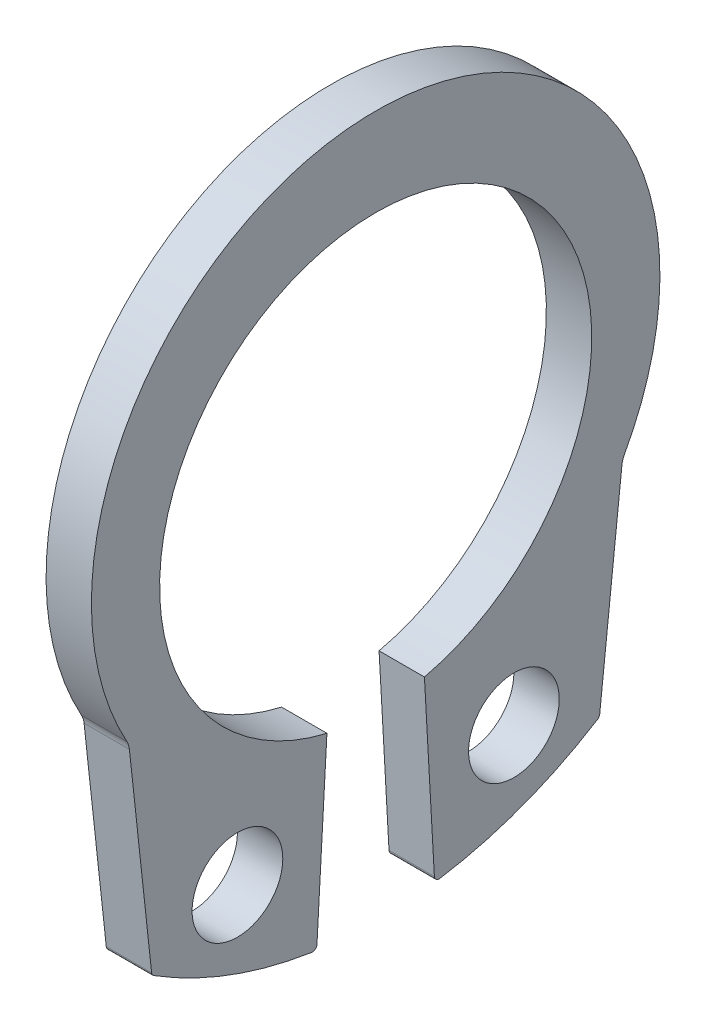
ISO-10303-21;
HEADER;
FILE_DESCRIPTION(('STEP AP214'),'2;1');
FILE_NAME('part.step','',(''),(''),'','','');
FILE_SCHEMA(('AUTOMOTIVE_DESIGN { 1 0 10303 214 1 1 1 1 }'));
ENDSEC;
DATA;
#1=APPLICATION_CONTEXT('core data for automotive mechanical design processes');
#2=APPLICATION_PROTOCOL_DEFINITION('international standard','automotive_design',2000,#1);
#3=PRODUCT_CONTEXT('',#1,'mechanical');
#4=PRODUCT('Part','Part','',(#3));
#5=PRODUCT_RELATED_PRODUCT_CATEGORY('part','',(#4));
#6=PRODUCT_DEFINITION_FORMATION('','',#4);
#7=PRODUCT_DEFINITION_CONTEXT('part definition',#1,'design');
#8=PRODUCT_DEFINITION('design','',#6,#7);
#9=PRODUCT_DEFINITION_SHAPE('','',#8);
#10=(LENGTH_UNIT() NAMED_UNIT(*) SI_UNIT(.MILLI.,.METRE.));
#11=(NAMED_UNIT(*) PLANE_ANGLE_UNIT() SI_UNIT($,.RADIAN.));
#12=(NAMED_UNIT(*) SI_UNIT($,.STERADIAN.) SOLID_ANGLE_UNIT());
#13=UNCERTAINTY_MEASURE_WITH_UNIT(LENGTH_MEASURE(1.E-05),#10,'distance_accuracy_value','');
#14=(GEOMETRIC_REPRESENTATION_CONTEXT(3) GLOBAL_UNCERTAINTY_ASSIGNED_CONTEXT((#13)) GLOBAL_UNIT_ASSIGNED_CONTEXT((#10,
#11,#12)) REPRESENTATION_CONTEXT('',''));
#15=CARTESIAN_POINT('',(0.,0.,0.));
#16=DIRECTION('',(0.,0.,1.));
#17=DIRECTION('',(1.,0.,0.));
#18=AXIS2_PLACEMENT_3D('',#15,#16,#17);
#19=CARTESIAN_POINT('',(0.85,-2.39792397685185,-5.01373537734668));
#20=DIRECTION('',(-1.,0.,0.));
#21=DIRECTION('',(0.,0.,1.));
#22=AXIS2_PLACEMENT_3D('',#19,#20,#21);
#23=CYLINDRICAL_SURFACE('',#22,0.4);
#24=CARTESIAN_POINT('',(0.85,-2.39792397685185,-5.01373537734668));
#25=DIRECTION('',(-1.,0.,0.));
#26=DIRECTION('',(0.,0.,-1.));
#27=AXIS2_PLACEMENT_3D('',#24,#25,#26);
#28=CIRCLE('',#27,0.4);
#29=CARTESIAN_POINT('',(0.85,-2.3547374993622,-4.61607355096397));
#30=VERTEX_POINT('',#29);
#31=CARTESIAN_POINT('',(0.85,-2.20449375873755,-4.6636143258227));
#32=VERTEX_POINT('',#31);
#33=EDGE_CURVE('E37',#30,#32,#28,.T.);
#34=ORIENTED_EDGE('',*,*,#33,.F.);
#35=DIRECTION('',(1.,0.,0.));
#36=VECTOR('',#35,1.);
#37=CARTESIAN_POINT('',(0.85,-2.3547374993622,-4.61607355096397));
#38=LINE('',#37,#36);
#39=CARTESIAN_POINT('',(0.,-2.3547374993622,-4.61607355096397));
#40=VERTEX_POINT('',#39);
#41=EDGE_CURVE('E211',#40,#30,#38,.T.);
#42=ORIENTED_EDGE('',*,*,#41,.F.);
#43=CARTESIAN_POINT('',(0.,-2.39792397685185,-5.01373537734668));
#44=DIRECTION('',(1.,0.,0.));
#45=DIRECTION('',(0.,0.,-1.));
#46=AXIS2_PLACEMENT_3D('',#43,#44,#45);
#47=CIRCLE('',#46,0.4);
#48=CARTESIAN_POINT('',(0.,-2.20449375873755,-4.6636143258227));
#49=VERTEX_POINT('',#48);
#50=EDGE_CURVE('E11',#49,#40,#47,.T.);
#51=ORIENTED_EDGE('',*,*,#50,.F.);
#52=DIRECTION('',(-1.,0.,0.));
#53=VECTOR('',#52,1.);
#54=CARTESIAN_POINT('',(0.85,-2.20449375873755,-4.6636143258227));
#55=LINE('',#54,#53);
#56=EDGE_CURVE('E187',#32,#49,#55,.T.);
#57=ORIENTED_EDGE('',*,*,#56,.F.);
#58=EDGE_LOOP('',(#34,#42,#51,#57));
#59=FACE_BOUND('',#58,.T.);
#60=ADVANCED_FACE('F17',(#59),#23,.F.);
#61=CARTESIAN_POINT('',(0.85,-2.39792397685184,5.01373537734669));
#62=DIRECTION('',(-1.,0.,0.));
#63=DIRECTION('',(0.,0.,1.));
#64=AXIS2_PLACEMENT_3D('',#61,#62,#63);
#65=CYLINDRICAL_SURFACE('',#64,0.4);
#66=CARTESIAN_POINT('',(0.85,-2.39792397685184,5.01373537734669));
#67=DIRECTION('',(-1.,0.,0.));
#68=DIRECTION('',(0.,0.,-1.));
#69=AXIS2_PLACEMENT_3D('',#66,#67,#68);
#70=CIRCLE('',#69,0.4);
#71=CARTESIAN_POINT('',(0.85,-2.20449375873754,4.66361432582271));
#72=VERTEX_POINT('',#71);
#73=CARTESIAN_POINT('',(0.85,-2.35473749936219,4.61607355096397));
#74=VERTEX_POINT('',#73);
#75=EDGE_CURVE('E175',#72,#74,#70,.T.);
#76=ORIENTED_EDGE('',*,*,#75,.F.);
#77=DIRECTION('',(1.,0.,0.));
#78=VECTOR('',#77,1.);
#79=CARTESIAN_POINT('',(0.85,-2.20449375873754,4.66361432582271));
#80=LINE('',#79,#78);
#81=CARTESIAN_POINT('',(0.,-2.20449375873754,4.66361432582271));
#82=VERTEX_POINT('',#81);
#83=EDGE_CURVE('E178',#82,#72,#80,.T.);
#84=ORIENTED_EDGE('',*,*,#83,.F.);
#85=CARTESIAN_POINT('',(0.,-2.39792397685184,5.01373537734669));
#86=DIRECTION('',(1.,0.,0.));
#87=DIRECTION('',(0.,0.,-1.));
#88=AXIS2_PLACEMENT_3D('',#85,#86,#87);
#89=CIRCLE('',#88,0.4);
#90=CARTESIAN_POINT('',(0.,-2.35473749936219,4.61607355096397));
#91=VERTEX_POINT('',#90);
#92=EDGE_CURVE('E25',#91,#82,#89,.T.);
#93=ORIENTED_EDGE('',*,*,#92,.F.);
#94=DIRECTION('',(-1.,0.,0.));
#95=VECTOR('',#94,1.);
#96=CARTESIAN_POINT('',(0.85,-2.35473749936219,4.61607355096397));
#97=LINE('',#96,#95);
#98=EDGE_CURVE('E223',#74,#91,#97,.T.);
#99=ORIENTED_EDGE('',*,*,#98,.F.);
#100=EDGE_LOOP('',(#76,#84,#93,#99));
#101=FACE_BOUND('',#100,.T.);
#102=ADVANCED_FACE('F179',(#101),#65,.F.);
#103=CARTESIAN_POINT('',(0.,0.,0.));
#104=DIRECTION('',(1.,0.,0.));
#105=DIRECTION('',(0.,1.,0.));
#106=AXIS2_PLACEMENT_3D('',#103,#104,#105);
#107=PLANE('',#106);
#108=CARTESIAN_POINT('',(0.,-5.56782224250959,2.59106511830008));
#109=DIRECTION('',(1.,0.,0.));
#110=DIRECTION('',(0.,0.,-1.));
#111=AXIS2_PLACEMENT_3D('',#108,#109,#110);
#112=CIRCLE('',#111,0.85);
#113=CARTESIAN_POINT('',(0.,-5.56782224250959,1.74106511830008));
#114=VERTEX_POINT('',#113);
#115=EDGE_CURVE('E337',#114,#114,#112,.T.);
#116=ORIENTED_EDGE('',*,*,#115,.T.);
#117=EDGE_LOOP('',(#116));
#118=FACE_BOUND('',#117,.T.);
#119=CARTESIAN_POINT('',(0.,-5.56782224250959,-2.59106511830008));
#120=DIRECTION('',(-1.,0.,0.));
#121=DIRECTION('',(0.,0.,-1.));
#122=AXIS2_PLACEMENT_3D('',#119,#120,#121);
#123=CIRCLE('',#122,0.85);
#124=CARTESIAN_POINT('',(0.,-5.56782224250959,-3.44106511830008));
#125=VERTEX_POINT('',#124);
#126=EDGE_CURVE('E332',#125,#125,#123,.T.);
#127=ORIENTED_EDGE('',*,*,#126,.F.);
#128=EDGE_LOOP('',(#127));
#129=FACE_BOUND('',#128,.T.);
#130=DIRECTION('',(0.,0.994154565956785,0.107966193724127));
#131=VECTOR('',#130,1.);
#132=CARTESIAN_POINT('',(0.,-0.522915110689556,4.81501131945199));
#133=LINE('',#132,#131);
#134=CARTESIAN_POINT('',(0.,-6.19075573329271,4.19947808185275));
#135=VERTEX_POINT('',#134);
#136=EDGE_CURVE('E170',#135,#91,#133,.T.);
#137=ORIENTED_EDGE('',*,*,#136,.T.);
#138=ORIENTED_EDGE('',*,*,#92,.T.);
#139=CARTESIAN_POINT('',(0.,0.371997807017542,0.));
#140=DIRECTION('',(1.,0.,0.));
#141=DIRECTION('',(0.,0.,-1.));
#142=AXIS2_PLACEMENT_3D('',#139,#140,#141);
#143=CIRCLE('',#142,5.32800219298246);
#144=EDGE_CURVE('E167',#49,#82,#143,.T.);
#145=ORIENTED_EDGE('',*,*,#144,.F.);
#146=ORIENTED_EDGE('',*,*,#50,.T.);
#147=DIRECTION('',(0.,0.994154565956785,-0.107966193724126));
#148=VECTOR('',#147,1.);
#149=CARTESIAN_POINT('',(0.,-0.522915110689551,-4.81501131945199));
#150=LINE('',#149,#148);
#151=CARTESIAN_POINT('',(0.,-6.19075573329271,-4.19947808185275));
#152=VERTEX_POINT('',#151);
#153=EDGE_CURVE('E231',#152,#40,#150,.T.);
#154=ORIENTED_EDGE('',*,*,#153,.F.);
#155=CARTESIAN_POINT('',(0.,-6.1811158134206,-4.11071353412026));
#156=DIRECTION('',(-1.,0.,0.));
#157=DIRECTION('',(0.,0.,-1.));
#158=AXIS2_PLACEMENT_3D('',#155,#156,#157);
#159=CIRCLE('',#158,0.0892864658797376);
#160=CARTESIAN_POINT('',(0.,-6.25675257958271,-4.15815984687302));
#161=VERTEX_POINT('',#160);
#162=EDGE_CURVE('E272',#152,#161,#159,.T.);
#163=ORIENTED_EDGE('',*,*,#162,.T.);
#164=CARTESIAN_POINT('',(0.,0.371997807017542,0.));
#165=DIRECTION('',(1.,0.,0.));
#166=DIRECTION('',(0.,0.,-1.));
#167=AXIS2_PLACEMENT_3D('',#164,#165,#166);
#168=CIRCLE('',#167,7.825);
#169=CARTESIAN_POINT('',(0.,-7.35997373313335,-1.20301334252644));
#170=VERTEX_POINT('',#169);
#171=EDGE_CURVE('E262',#170,#161,#168,.T.);
#172=ORIENTED_EDGE('',*,*,#171,.F.);
#173=CARTESIAN_POINT('',(0.,-7.27174876021286,-1.18928646587975));
#174=DIRECTION('',(-1.,0.,0.));
#175=DIRECTION('',(0.,0.,-1.));
#176=AXIS2_PLACEMENT_3D('',#173,#174,#175);
#177=CIRCLE('',#176,0.0892864658797398);
#178=CARTESIAN_POINT('',(0.,-7.27674135002132,-1.1001396934407));
#179=VERTEX_POINT('',#178);
#180=EDGE_CURVE('E287',#170,#179,#177,.T.);
#181=ORIENTED_EDGE('',*,*,#180,.T.);
#182=DIRECTION('',(0.,0.998435446634371,0.0559165351575345));
#183=VECTOR('',#182,1.);
#184=CARTESIAN_POINT('',(0.,0.0386678666475541,-0.690446369716576));
#185=LINE('',#184,#183);
#186=CARTESIAN_POINT('',(0.,-3.94561359779142,-0.913582692985955));
#187=VERTEX_POINT('',#186);
#188=EDGE_CURVE('E212',#179,#187,#185,.T.);
#189=ORIENTED_EDGE('',*,*,#188,.T.);
#190=CARTESIAN_POINT('',(0.,0.,0.));
#191=DIRECTION('',(1.,0.,0.));
#192=DIRECTION('',(0.,0.,-1.));
#193=AXIS2_PLACEMENT_3D('',#190,#191,#192);
#194=CIRCLE('',#193,4.05);
#195=CARTESIAN_POINT('',(0.,-3.94561359779142,0.913582692985955));
#196=VERTEX_POINT('',#195);
#197=EDGE_CURVE('E202',#187,#196,#194,.T.);
#198=ORIENTED_EDGE('',*,*,#197,.T.);
#199=DIRECTION('',(0.,0.998435446634371,-0.0559165351575343));
#200=VECTOR('',#199,1.);
#201=CARTESIAN_POINT('',(0.,0.0386678666475539,0.690446369716574));
#202=LINE('',#201,#200);
#203=CARTESIAN_POINT('',(0.,-7.27674135002132,1.1001396934407));
#204=VERTEX_POINT('',#203);
#205=EDGE_CURVE('E276',#204,#196,#202,.T.);
#206=ORIENTED_EDGE('',*,*,#205,.F.);
#207=CARTESIAN_POINT('',(0.,-7.27174876021286,1.18928646587974));
#208=DIRECTION('',(1.,0.,0.));
#209=DIRECTION('',(0.,0.,-1.));
#210=AXIS2_PLACEMENT_3D('',#207,#208,#209);
#211=CIRCLE('',#210,0.0892864658797448);
#212=CARTESIAN_POINT('',(0.,-7.35997373313335,1.20301334252644));
#213=VERTEX_POINT('',#212);
#214=EDGE_CURVE('E252',#213,#204,#211,.T.);
#215=ORIENTED_EDGE('',*,*,#214,.F.);
#216=CARTESIAN_POINT('',(0.,0.371997807017542,0.));
#217=DIRECTION('',(1.,0.,0.));
#218=DIRECTION('',(0.,0.,-1.));
#219=AXIS2_PLACEMENT_3D('',#216,#217,#218);
#220=CIRCLE('',#219,7.825);
#221=CARTESIAN_POINT('',(0.,-6.25675257958271,4.15815984687302));
#222=VERTEX_POINT('',#221);
#223=EDGE_CURVE('E243',#222,#213,#220,.T.);
#224=ORIENTED_EDGE('',*,*,#223,.F.);
#225=CARTESIAN_POINT('',(0.,-6.1811158134206,4.11071353412026));
#226=DIRECTION('',(1.,0.,0.));
#227=DIRECTION('',(0.,0.,-1.));
#228=AXIS2_PLACEMENT_3D('',#225,#226,#227);
#229=CIRCLE('',#228,0.0892864658797463);
#230=EDGE_CURVE('E227',#135,#222,#229,.T.);
#231=ORIENTED_EDGE('',*,*,#230,.F.);
#232=EDGE_LOOP('',(#137,#138,#145,#146,#154,#163,#172,#181,#189,#198,#206,#215,#224,#231));
#233=FACE_BOUND('',#232,.T.);
#234=ADVANCED_FACE('F165',(#118,#129,#233),#107,.F.);
#235=CARTESIAN_POINT('',(0.85,0.,0.));
#236=DIRECTION('',(1.,0.,0.));
#237=DIRECTION('',(0.,1.,0.));
#238=AXIS2_PLACEMENT_3D('',#235,#236,#237);
#239=PLANE('',#238);
#240=CARTESIAN_POINT('',(0.85,-5.56782224250959,2.59106511830008));
#241=DIRECTION('',(1.,0.,0.));
#242=DIRECTION('',(0.,0.,-1.));
#243=AXIS2_PLACEMENT_3D('',#240,#241,#242);
#244=CIRCLE('',#243,0.85);
#245=CARTESIAN_POINT('',(0.85,-5.56782224250959,1.74106511830008));
#246=VERTEX_POINT('',#245);
#247=EDGE_CURVE('E328',#246,#246,#244,.T.);
#248=ORIENTED_EDGE('',*,*,#247,.F.);
#249=EDGE_LOOP('',(#248));
#250=FACE_BOUND('',#249,.T.);
#251=CARTESIAN_POINT('',(0.85,-5.56782224250959,-2.59106511830008));
#252=DIRECTION('',(-1.,0.,0.));
#253=DIRECTION('',(0.,0.,-1.));
#254=AXIS2_PLACEMENT_3D('',#251,#252,#253);
#255=CIRCLE('',#254,0.85);
#256=CARTESIAN_POINT('',(0.85,-5.56782224250959,-3.44106511830008));
#257=VERTEX_POINT('',#256);
#258=EDGE_CURVE('E386',#257,#257,#255,.T.);
#259=ORIENTED_EDGE('',*,*,#258,.T.);
#260=EDGE_LOOP('',(#259));
#261=FACE_BOUND('',#260,.T.);
#262=DIRECTION('',(0.,0.994154565956785,0.107966193724127));
#263=VECTOR('',#262,1.);
#264=CARTESIAN_POINT('',(0.85,-0.522915110689556,4.81501131945199));
#265=LINE('',#264,#263);
#266=CARTESIAN_POINT('',(0.85,-6.19075573329271,4.19947808185275));
#267=VERTEX_POINT('',#266);
#268=EDGE_CURVE('E201',#267,#74,#265,.T.);
#269=ORIENTED_EDGE('',*,*,#268,.F.);
#270=CARTESIAN_POINT('',(0.85,-6.1811158134206,4.11071353412026));
#271=DIRECTION('',(1.,0.,0.));
#272=DIRECTION('',(0.,0.,-1.));
#273=AXIS2_PLACEMENT_3D('',#270,#271,#272);
#274=CIRCLE('',#273,0.0892864658797463);
#275=CARTESIAN_POINT('',(0.85,-6.25675257958271,4.15815984687302));
#276=VERTEX_POINT('',#275);
#277=EDGE_CURVE('E239',#267,#276,#274,.T.);
#278=ORIENTED_EDGE('',*,*,#277,.T.);
#279=CARTESIAN_POINT('',(0.85,0.371997807017542,0.));
#280=DIRECTION('',(1.,0.,0.));
#281=DIRECTION('',(0.,0.,-1.));
#282=AXIS2_PLACEMENT_3D('',#279,#280,#281);
#283=CIRCLE('',#282,7.825);
#284=CARTESIAN_POINT('',(0.85,-7.35997373313335,1.20301334252644));
#285=VERTEX_POINT('',#284);
#286=EDGE_CURVE('E248',#276,#285,#283,.T.);
#287=ORIENTED_EDGE('',*,*,#286,.T.);
#288=CARTESIAN_POINT('',(0.85,-7.27174876021286,1.18928646587974));
#289=DIRECTION('',(1.,0.,0.));
#290=DIRECTION('',(0.,0.,-1.));
#291=AXIS2_PLACEMENT_3D('',#288,#289,#290);
#292=CIRCLE('',#291,0.0892864658797448);
#293=CARTESIAN_POINT('',(0.85,-7.27674135002132,1.1001396934407));
#294=VERTEX_POINT('',#293);
#295=EDGE_CURVE('E266',#285,#294,#292,.T.);
#296=ORIENTED_EDGE('',*,*,#295,.T.);
#297=DIRECTION('',(0.,0.998435446634371,-0.0559165351575343));
#298=VECTOR('',#297,1.);
#299=CARTESIAN_POINT('',(0.85,0.0386678666475539,0.690446369716574));
#300=LINE('',#299,#298);
#301=CARTESIAN_POINT('',(0.85,-3.94561359779142,0.913582692985955));
#302=VERTEX_POINT('',#301);
#303=EDGE_CURVE('E216',#294,#302,#300,.T.);
#304=ORIENTED_EDGE('',*,*,#303,.T.);
#305=CARTESIAN_POINT('',(0.85,0.,0.));
#306=DIRECTION('',(1.,0.,0.));
#307=DIRECTION('',(0.,0.,-1.));
#308=AXIS2_PLACEMENT_3D('',#305,#306,#307);
#309=CIRCLE('',#308,4.05);
#310=CARTESIAN_POINT('',(0.85,-3.94561359779142,-0.913582692985955));
#311=VERTEX_POINT('',#310);
#312=EDGE_CURVE('E184',#311,#302,#309,.T.);
#313=ORIENTED_EDGE('',*,*,#312,.F.);
#314=DIRECTION('',(0.,0.998435446634371,0.0559165351575345));
#315=VECTOR('',#314,1.);
#316=CARTESIAN_POINT('',(0.85,0.0386678666475541,-0.690446369716576));
#317=LINE('',#316,#315);
#318=CARTESIAN_POINT('',(0.85,-7.27674135002132,-1.1001396934407));
#319=VERTEX_POINT('',#318);
#320=EDGE_CURVE('E284',#319,#311,#317,.T.);
#321=ORIENTED_EDGE('',*,*,#320,.F.);
#322=CARTESIAN_POINT('',(0.85,-7.27174876021286,-1.18928646587975));
#323=DIRECTION('',(-1.,0.,0.));
#324=DIRECTION('',(0.,0.,-1.));
#325=AXIS2_PLACEMENT_3D('',#322,#323,#324);
#326=CIRCLE('',#325,0.0892864658797398);
#327=CARTESIAN_POINT('',(0.85,-7.35997373313335,-1.20301334252644));
#328=VERTEX_POINT('',#327);
#329=EDGE_CURVE('E295',#328,#319,#326,.T.);
#330=ORIENTED_EDGE('',*,*,#329,.F.);
#331=CARTESIAN_POINT('',(0.85,0.371997807017542,0.));
#332=DIRECTION('',(1.,0.,0.));
#333=DIRECTION('',(0.,0.,-1.));
#334=AXIS2_PLACEMENT_3D('',#331,#332,#333);
#335=CIRCLE('',#334,7.825);
#336=CARTESIAN_POINT('',(0.85,-6.25675257958271,-4.15815984687302));
#337=VERTEX_POINT('',#336);
#338=EDGE_CURVE('E261',#328,#337,#335,.T.);
#339=ORIENTED_EDGE('',*,*,#338,.T.);
#340=CARTESIAN_POINT('',(0.85,-6.1811158134206,-4.11071353412026));
#341=DIRECTION('',(-1.,0.,0.));
#342=DIRECTION('',(0.,0.,-1.));
#343=AXIS2_PLACEMENT_3D('',#340,#341,#342);
#344=CIRCLE('',#343,0.0892864658797376);
#345=CARTESIAN_POINT('',(0.85,-6.19075573329271,-4.19947808185275));
#346=VERTEX_POINT('',#345);
#347=EDGE_CURVE('E271',#346,#337,#344,.T.);
#348=ORIENTED_EDGE('',*,*,#347,.F.);
#349=DIRECTION('',(0.,0.994154565956785,-0.107966193724126));
#350=VECTOR('',#349,1.);
#351=CARTESIAN_POINT('',(0.85,-0.522915110689551,-4.81501131945199));
#352=LINE('',#351,#350);
#353=EDGE_CURVE('E208',#346,#30,#352,.T.);
#354=ORIENTED_EDGE('',*,*,#353,.T.);
#355=ORIENTED_EDGE('',*,*,#33,.T.);
#356=CARTESIAN_POINT('',(0.85,0.371997807017542,0.));
#357=DIRECTION('',(1.,0.,0.));
#358=DIRECTION('',(0.,0.,-1.));
#359=AXIS2_PLACEMENT_3D('',#356,#357,#358);
#360=CIRCLE('',#359,5.32800219298246);
#361=EDGE_CURVE('E194',#32,#72,#360,.T.);
#362=ORIENTED_EDGE('',*,*,#361,.T.);
#363=ORIENTED_EDGE('',*,*,#75,.T.);
#364=EDGE_LOOP('',(#269,#278,#287,#296,#304,#313,#321,#330,#339,#348,#354,#355,#362,#363));
#365=FACE_BOUND('',#364,.T.);
#366=ADVANCED_FACE('F314',(#250,#261,#365),#239,.T.);
#367=CARTESIAN_POINT('',(0.85,-0.522915110689551,-4.81501131945199));
#368=DIRECTION('',(0.,0.107966193724126,0.994154565956785));
#369=DIRECTION('',(1.,0.,0.));
#370=AXIS2_PLACEMENT_3D('',#367,#368,#369);
#371=PLANE('',#370);
#372=ORIENTED_EDGE('',*,*,#153,.T.);
#373=ORIENTED_EDGE('',*,*,#41,.T.);
#374=ORIENTED_EDGE('',*,*,#353,.F.);
#375=DIRECTION('',(-1.,0.,0.));
#376=VECTOR('',#375,1.);
#377=CARTESIAN_POINT('',(0.85,-6.19075573329271,-4.19947808185275));
#378=LINE('',#377,#376);
#379=EDGE_CURVE('E267',#346,#152,#378,.T.);
#380=ORIENTED_EDGE('',*,*,#379,.T.);
#381=EDGE_LOOP('',(#372,#373,#374,#380));
#382=FACE_BOUND('',#381,.T.);
#383=ADVANCED_FACE('F537',(#382),#371,.F.);
#384=CARTESIAN_POINT('',(0.85,-6.1811158134206,-4.11071353412026));
#385=DIRECTION('',(-1.,0.,0.));
#386=DIRECTION('',(0.,0.,1.));
#387=AXIS2_PLACEMENT_3D('',#384,#385,#386);
#388=CYLINDRICAL_SURFACE('',#387,0.0892864658797376);
#389=ORIENTED_EDGE('',*,*,#162,.F.);
#390=ORIENTED_EDGE('',*,*,#379,.F.);
#391=ORIENTED_EDGE('',*,*,#347,.T.);
#392=DIRECTION('',(-1.,0.,0.));
#393=VECTOR('',#392,1.);
#394=CARTESIAN_POINT('',(0.85,-6.25675257958271,-4.15815984687302));
#395=LINE('',#394,#393);
#396=EDGE_CURVE('E257',#337,#161,#395,.T.);
#397=ORIENTED_EDGE('',*,*,#396,.T.);
#398=EDGE_LOOP('',(#389,#390,#391,#397));
#399=FACE_BOUND('',#398,.T.);
#400=ADVANCED_FACE('F478',(#399),#388,.T.);
#401=CARTESIAN_POINT('',(0.85,0.371997807017542,0.));
#402=DIRECTION('',(-1.,0.,0.));
#403=DIRECTION('',(0.,0.,1.));
#404=AXIS2_PLACEMENT_3D('',#401,#402,#403);
#405=CYLINDRICAL_SURFACE('',#404,7.825);
#406=ORIENTED_EDGE('',*,*,#171,.T.);
#407=ORIENTED_EDGE('',*,*,#396,.F.);
#408=ORIENTED_EDGE('',*,*,#338,.F.);
#409=DIRECTION('',(-1.,0.,0.));
#410=VECTOR('',#409,1.);
#411=CARTESIAN_POINT('',(0.85,-7.35997373313335,-1.20301334252644));
#412=LINE('',#411,#410);
#413=EDGE_CURVE('E291',#328,#170,#412,.T.);
#414=ORIENTED_EDGE('',*,*,#413,.T.);
#415=EDGE_LOOP('',(#406,#407,#408,#414));
#416=FACE_BOUND('',#415,.T.);
#417=ADVANCED_FACE('F444',(#416),#405,.T.);
#418=CARTESIAN_POINT('',(0.85,-7.27174876021286,-1.18928646587975));
#419=DIRECTION('',(-1.,0.,0.));
#420=DIRECTION('',(0.,0.,1.));
#421=AXIS2_PLACEMENT_3D('',#418,#419,#420);
#422=CYLINDRICAL_SURFACE('',#421,0.0892864658797398);
#423=ORIENTED_EDGE('',*,*,#180,.F.);
#424=ORIENTED_EDGE('',*,*,#413,.F.);
#425=ORIENTED_EDGE('',*,*,#329,.T.);
#426=DIRECTION('',(-1.,0.,0.));
#427=VECTOR('',#426,1.);
#428=CARTESIAN_POINT('',(0.85,-7.27674135002132,-1.1001396934407));
#429=LINE('',#428,#427);
#430=EDGE_CURVE('E215',#319,#179,#429,.T.);
#431=ORIENTED_EDGE('',*,*,#430,.T.);
#432=EDGE_LOOP('',(#423,#424,#425,#431));
#433=FACE_BOUND('',#432,.T.);
#434=ADVANCED_FACE('F438',(#433),#422,.T.);
#435=CARTESIAN_POINT('',(0.85,0.0386678666475541,-0.690446369716576));
#436=DIRECTION('',(0.,-0.0559165351575345,0.998435446634371));
#437=DIRECTION('',(-1.,0.,0.));
#438=AXIS2_PLACEMENT_3D('',#435,#436,#437);
#439=PLANE('',#438);
#440=ORIENTED_EDGE('',*,*,#188,.F.);
#441=ORIENTED_EDGE('',*,*,#430,.F.);
#442=ORIENTED_EDGE('',*,*,#320,.T.);
#443=DIRECTION('',(-1.,0.,0.));
#444=VECTOR('',#443,1.);
#445=CARTESIAN_POINT('',(0.85,-3.94561359779142,-0.913582692985955));
#446=LINE('',#445,#444);
#447=EDGE_CURVE('E198',#311,#187,#446,.T.);
#448=ORIENTED_EDGE('',*,*,#447,.T.);
#449=EDGE_LOOP('',(#440,#441,#442,#448));
#450=FACE_BOUND('',#449,.T.);
#451=ADVANCED_FACE('F443',(#450),#439,.T.);
#452=CARTESIAN_POINT('',(0.85,0.0386678666475539,0.690446369716574));
#453=DIRECTION('',(0.,0.0559165351575343,0.998435446634371));
#454=DIRECTION('',(1.,0.,0.));
#455=AXIS2_PLACEMENT_3D('',#452,#453,#454);
#456=PLANE('',#455);
#457=ORIENTED_EDGE('',*,*,#205,.T.);
#458=DIRECTION('',(-1.,0.,0.));
#459=VECTOR('',#458,1.);
#460=CARTESIAN_POINT('',(0.85,-3.94561359779142,0.913582692985955));
#461=LINE('',#460,#459);
#462=EDGE_CURVE('E207',#302,#196,#461,.T.);
#463=ORIENTED_EDGE('',*,*,#462,.F.);
#464=ORIENTED_EDGE('',*,*,#303,.F.);
#465=DIRECTION('',(-1.,0.,0.));
#466=VECTOR('',#465,1.);
#467=CARTESIAN_POINT('',(0.85,-7.27674135002132,1.1001396934407));
#468=LINE('',#467,#466);
#469=EDGE_CURVE('E256',#294,#204,#468,.T.);
#470=ORIENTED_EDGE('',*,*,#469,.T.);
#471=EDGE_LOOP('',(#457,#463,#464,#470));
#472=FACE_BOUND('',#471,.T.);
#473=ADVANCED_FACE('F528',(#472),#456,.F.);
#474=CARTESIAN_POINT('',(0.85,-7.27174876021286,1.18928646587974));
#475=DIRECTION('',(-1.,0.,0.));
#476=DIRECTION('',(0.,0.,1.));
#477=AXIS2_PLACEMENT_3D('',#474,#475,#476);
#478=CYLINDRICAL_SURFACE('',#477,0.0892864658797448);
#479=ORIENTED_EDGE('',*,*,#214,.T.);
#480=ORIENTED_EDGE('',*,*,#469,.F.);
#481=ORIENTED_EDGE('',*,*,#295,.F.);
#482=DIRECTION('',(-1.,0.,0.));
#483=VECTOR('',#482,1.);
#484=CARTESIAN_POINT('',(0.85,-7.35997373313335,1.20301334252644));
#485=LINE('',#484,#483);
#486=EDGE_CURVE('E244',#285,#213,#485,.T.);
#487=ORIENTED_EDGE('',*,*,#486,.T.);
#488=EDGE_LOOP('',(#479,#480,#481,#487));
#489=FACE_BOUND('',#488,.T.);
#490=ADVANCED_FACE('F519',(#489),#478,.T.);
#491=CARTESIAN_POINT('',(0.85,0.371997807017542,0.));
#492=DIRECTION('',(-1.,0.,0.));
#493=DIRECTION('',(0.,0.,1.));
#494=AXIS2_PLACEMENT_3D('',#491,#492,#493);
#495=CYLINDRICAL_SURFACE('',#494,7.825);
#496=ORIENTED_EDGE('',*,*,#223,.T.);
#497=ORIENTED_EDGE('',*,*,#486,.F.);
#498=ORIENTED_EDGE('',*,*,#286,.F.);
#499=DIRECTION('',(-1.,0.,0.));
#500=VECTOR('',#499,1.);
#501=CARTESIAN_POINT('',(0.85,-6.25675257958271,4.15815984687302));
#502=LINE('',#501,#500);
#503=EDGE_CURVE('E235',#276,#222,#502,.T.);
#504=ORIENTED_EDGE('',*,*,#503,.T.);
#505=EDGE_LOOP('',(#496,#497,#498,#504));
#506=FACE_BOUND('',#505,.T.);
#507=ADVANCED_FACE('F503',(#506),#495,.T.);
#508=CARTESIAN_POINT('',(0.85,-6.1811158134206,4.11071353412026));
#509=DIRECTION('',(-1.,0.,0.));
#510=DIRECTION('',(0.,0.,1.));
#511=AXIS2_PLACEMENT_3D('',#508,#509,#510);
#512=CYLINDRICAL_SURFACE('',#511,0.0892864658797463);
#513=ORIENTED_EDGE('',*,*,#230,.T.);
#514=ORIENTED_EDGE('',*,*,#503,.F.);
#515=ORIENTED_EDGE('',*,*,#277,.F.);
#516=DIRECTION('',(-1.,0.,0.));
#517=VECTOR('',#516,1.);
#518=CARTESIAN_POINT('',(0.85,-6.19075573329271,4.19947808185275));
#519=LINE('',#518,#517);
#520=EDGE_CURVE('E222',#267,#135,#519,.T.);
#521=ORIENTED_EDGE('',*,*,#520,.T.);
#522=EDGE_LOOP('',(#513,#514,#515,#521));
#523=FACE_BOUND('',#522,.T.);
#524=ADVANCED_FACE('F495',(#523),#512,.T.);
#525=CARTESIAN_POINT('',(0.85,-0.522915110689556,4.81501131945199));
#526=DIRECTION('',(0.,-0.107966193724127,0.994154565956785));
#527=DIRECTION('',(-1.,0.,0.));
#528=AXIS2_PLACEMENT_3D('',#525,#526,#527);
#529=PLANE('',#528);
#530=ORIENTED_EDGE('',*,*,#268,.T.);
#531=ORIENTED_EDGE('',*,*,#98,.T.);
#532=ORIENTED_EDGE('',*,*,#136,.F.);
#533=ORIENTED_EDGE('',*,*,#520,.F.);
#534=EDGE_LOOP('',(#530,#531,#532,#533));
#535=FACE_BOUND('',#534,.T.);
#536=ADVANCED_FACE('F319',(#535),#529,.T.);
#537=CARTESIAN_POINT('',(0.85,0.,0.));
#538=DIRECTION('',(-1.,0.,0.));
#539=DIRECTION('',(0.,1.,0.));
#540=AXIS2_PLACEMENT_3D('',#537,#538,#539);
#541=CYLINDRICAL_SURFACE('',#540,4.05);
#542=ORIENTED_EDGE('',*,*,#312,.T.);
#543=ORIENTED_EDGE('',*,*,#462,.T.);
#544=ORIENTED_EDGE('',*,*,#197,.F.);
#545=ORIENTED_EDGE('',*,*,#447,.F.);
#546=EDGE_LOOP('',(#542,#543,#544,#545));
#547=FACE_BOUND('',#546,.T.);
#548=ADVANCED_FACE('F470',(#547),#541,.F.);
#549=CARTESIAN_POINT('',(0.85,0.371997807017542,0.));
#550=DIRECTION('',(-1.,0.,0.));
#551=DIRECTION('',(0.,1.,0.));
#552=AXIS2_PLACEMENT_3D('',#549,#550,#551);
#553=CYLINDRICAL_SURFACE('',#552,5.32800219298246);
#554=ORIENTED_EDGE('',*,*,#361,.F.);
#555=ORIENTED_EDGE('',*,*,#56,.T.);
#556=ORIENTED_EDGE('',*,*,#144,.T.);
#557=ORIENTED_EDGE('',*,*,#83,.T.);
#558=EDGE_LOOP('',(#554,#555,#556,#557));
#559=FACE_BOUND('',#558,.T.);
#560=ADVANCED_FACE('F186',(#559),#553,.T.);
#561=CARTESIAN_POINT('',(0.85,-5.56782224250959,2.59106511830008));
#562=DIRECTION('',(-1.,0.,0.));
#563=DIRECTION('',(0.,0.,1.));
#564=AXIS2_PLACEMENT_3D('',#561,#562,#563);
#565=CYLINDRICAL_SURFACE('',#564,0.85);
#566=ORIENTED_EDGE('',*,*,#247,.T.);
#567=DIRECTION('',(-1.,0.,0.));
#568=VECTOR('',#567,1.);
#569=CARTESIAN_POINT('',(0.85,-5.56782224250959,1.74106511830008));
#570=LINE('',#569,#568);
#571=EDGE_CURVE('E331',#246,#114,#570,.T.);
#572=ORIENTED_EDGE('',*,*,#571,.T.);
#573=ORIENTED_EDGE('',*,*,#115,.F.);
#574=ORIENTED_EDGE('',*,*,#571,.F.);
#575=EDGE_LOOP('',(#566,#572,#573,#574));
#576=FACE_BOUND('',#575,.T.);
#577=ADVANCED_FACE('F431',(#576),#565,.F.);
#578=CARTESIAN_POINT('',(0.85,-5.56782224250959,-2.59106511830008));
#579=DIRECTION('',(-1.,0.,0.));
#580=DIRECTION('',(0.,0.,1.));
#581=AXIS2_PLACEMENT_3D('',#578,#579,#580);
#582=CYLINDRICAL_SURFACE('',#581,0.85);
#583=ORIENTED_EDGE('',*,*,#258,.F.);
#584=DIRECTION('',(-1.,0.,0.));
#585=VECTOR('',#584,1.);
#586=CARTESIAN_POINT('',(0.85,-5.56782224250959,-3.44106511830008));
#587=LINE('',#586,#585);
#588=EDGE_CURVE('E326',#257,#125,#587,.T.);
#589=ORIENTED_EDGE('',*,*,#588,.T.);
#590=ORIENTED_EDGE('',*,*,#126,.T.);
#591=ORIENTED_EDGE('',*,*,#588,.F.);
#592=EDGE_LOOP('',(#583,#589,#590,#591));
#593=FACE_BOUND('',#592,.T.);
#594=ADVANCED_FACE('F426',(#593),#582,.F.);
#595=CLOSED_SHELL('',(#60,#102,#234,#366,#383,#400,#417,#434,#451,#473,#490,#507,#524,#536,#548,
#560,#577,#594));
#596=MANIFOLD_SOLID_BREP('B1',#595);
#597=ADVANCED_BREP_SHAPE_REPRESENTATION('',(#18,#596),#14);
#598=SHAPE_DEFINITION_REPRESENTATION(#9,#597);
ENDSEC;
END-ISO-10303-21;
